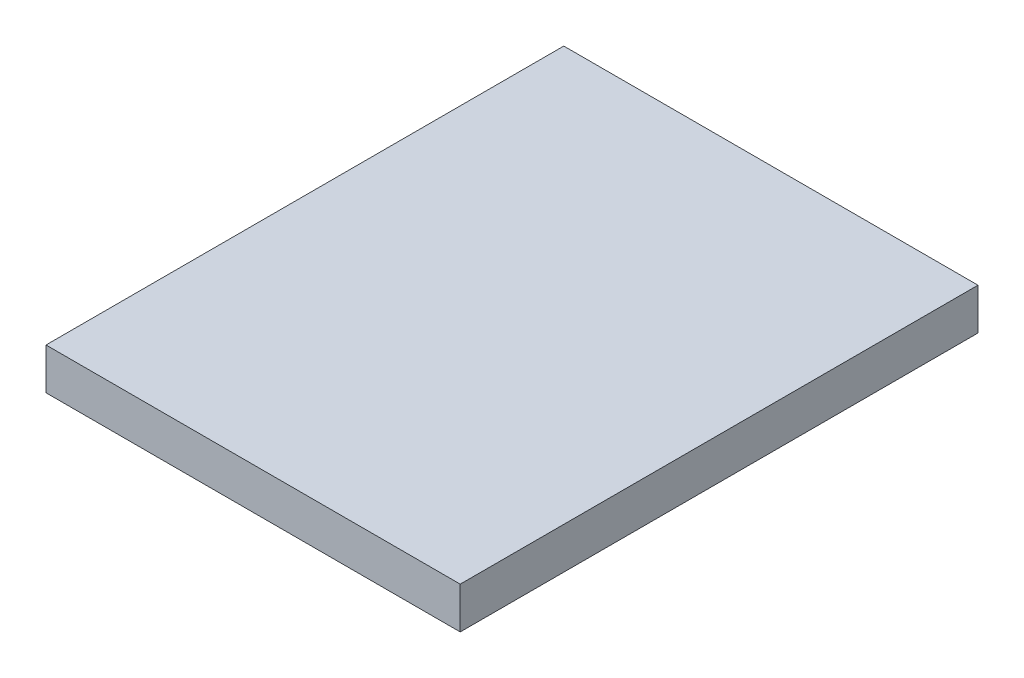
ISO-10303-21;
HEADER;
FILE_DESCRIPTION(('STEP AP214'),'2;1');
FILE_NAME('part.step','',(''),(''),'','','');
FILE_SCHEMA(('AUTOMOTIVE_DESIGN { 1 0 10303 214 1 1 1 1 }'));
ENDSEC;
DATA;
#1=APPLICATION_CONTEXT('core data for automotive mechanical design processes');
#2=APPLICATION_PROTOCOL_DEFINITION('international standard','automotive_design',2000,#1);
#3=PRODUCT_CONTEXT('',#1,'mechanical');
#4=PRODUCT('Part','Part','',(#3));
#5=PRODUCT_RELATED_PRODUCT_CATEGORY('part','',(#4));
#6=PRODUCT_DEFINITION_FORMATION('','',#4);
#7=PRODUCT_DEFINITION_CONTEXT('part definition',#1,'design');
#8=PRODUCT_DEFINITION('design','',#6,#7);
#9=PRODUCT_DEFINITION_SHAPE('','',#8);
#10=(LENGTH_UNIT() NAMED_UNIT(*) SI_UNIT(.MILLI.,.METRE.));
#11=(NAMED_UNIT(*) PLANE_ANGLE_UNIT() SI_UNIT($,.RADIAN.));
#12=(NAMED_UNIT(*) SI_UNIT($,.STERADIAN.) SOLID_ANGLE_UNIT());
#13=UNCERTAINTY_MEASURE_WITH_UNIT(LENGTH_MEASURE(1.E-05),#10,'distance_accuracy_value','');
#14=(GEOMETRIC_REPRESENTATION_CONTEXT(3) GLOBAL_UNCERTAINTY_ASSIGNED_CONTEXT((#13)) GLOBAL_UNIT_ASSIGNED_CONTEXT((#10,
#11,#12)) REPRESENTATION_CONTEXT('',''));
#15=CARTESIAN_POINT('',(0.,0.,0.));
#16=DIRECTION('',(0.,0.,1.));
#17=DIRECTION('',(1.,0.,0.));
#18=AXIS2_PLACEMENT_3D('',#15,#16,#17);
#19=CARTESIAN_POINT('',(-1000.,100.,-1250.));
#20=DIRECTION('',(1.,0.,0.));
#21=DIRECTION('',(0.,0.,-1.));
#22=AXIS2_PLACEMENT_3D('',#19,#20,#21);
#23=PLANE('',#22);
#24=DIRECTION('',(0.,0.,1.));
#25=VECTOR('',#24,1.);
#26=CARTESIAN_POINT('',(-1000.,-100.,-1250.));
#27=LINE('',#26,#25);
#28=CARTESIAN_POINT('',(-1000.,-100.,-1250.));
#29=VERTEX_POINT('',#28);
#30=CARTESIAN_POINT('',(-1000.,-100.,1250.));
#31=VERTEX_POINT('',#30);
#32=EDGE_CURVE('E107',#29,#31,#27,.T.);
#33=ORIENTED_EDGE('',*,*,#32,.T.);
#34=DIRECTION('',(0.,-1.,0.));
#35=VECTOR('',#34,1.);
#36=CARTESIAN_POINT('',(-1000.,100.,1250.));
#37=LINE('',#36,#35);
#38=CARTESIAN_POINT('',(-1000.,100.,1250.));
#39=VERTEX_POINT('',#38);
#40=EDGE_CURVE('E11',#39,#31,#37,.T.);
#41=ORIENTED_EDGE('',*,*,#40,.F.);
#42=DIRECTION('',(0.,0.,1.));
#43=VECTOR('',#42,1.);
#44=CARTESIAN_POINT('',(-1000.,100.,-1250.));
#45=LINE('',#44,#43);
#46=CARTESIAN_POINT('',(-1000.,100.,-1250.));
#47=VERTEX_POINT('',#46);
#48=EDGE_CURVE('E91',#47,#39,#45,.T.);
#49=ORIENTED_EDGE('',*,*,#48,.F.);
#50=DIRECTION('',(0.,-1.,0.));
#51=VECTOR('',#50,1.);
#52=CARTESIAN_POINT('',(-1000.,100.,-1250.));
#53=LINE('',#52,#51);
#54=EDGE_CURVE('E103',#47,#29,#53,.T.);
#55=ORIENTED_EDGE('',*,*,#54,.T.);
#56=EDGE_LOOP('',(#33,#41,#49,#55));
#57=FACE_BOUND('',#56,.T.);
#58=ADVANCED_FACE('F39',(#57),#23,.F.);
#59=CARTESIAN_POINT('',(1000.,100.,1250.));
#60=DIRECTION('',(0.,0.,-1.));
#61=DIRECTION('',(-1.,0.,0.));
#62=AXIS2_PLACEMENT_3D('',#59,#60,#61);
#63=PLANE('',#62);
#64=DIRECTION('',(1.,0.,0.));
#65=VECTOR('',#64,1.);
#66=CARTESIAN_POINT('',(1000.,-100.,1250.));
#67=LINE('',#66,#65);
#68=CARTESIAN_POINT('',(1000.,-100.,1250.));
#69=VERTEX_POINT('',#68);
#70=EDGE_CURVE('E96',#31,#69,#67,.T.);
#71=ORIENTED_EDGE('',*,*,#70,.T.);
#72=DIRECTION('',(0.,-1.,0.));
#73=VECTOR('',#72,1.);
#74=CARTESIAN_POINT('',(1000.,100.,1250.));
#75=LINE('',#74,#73);
#76=CARTESIAN_POINT('',(1000.,100.,1250.));
#77=VERTEX_POINT('',#76);
#78=EDGE_CURVE('E48',#77,#69,#75,.T.);
#79=ORIENTED_EDGE('',*,*,#78,.F.);
#80=DIRECTION('',(1.,0.,0.));
#81=VECTOR('',#80,1.);
#82=CARTESIAN_POINT('',(1000.,100.,1250.));
#83=LINE('',#82,#81);
#84=EDGE_CURVE('E86',#39,#77,#83,.T.);
#85=ORIENTED_EDGE('',*,*,#84,.F.);
#86=ORIENTED_EDGE('',*,*,#40,.T.);
#87=EDGE_LOOP('',(#71,#79,#85,#86));
#88=FACE_BOUND('',#87,.T.);
#89=ADVANCED_FACE('F95',(#88),#63,.F.);
#90=CARTESIAN_POINT('',(1000.,100.,-1250.));
#91=DIRECTION('',(-1.,0.,0.));
#92=DIRECTION('',(0.,0.,1.));
#93=AXIS2_PLACEMENT_3D('',#90,#91,#92);
#94=PLANE('',#93);
#95=DIRECTION('',(0.,0.,-1.));
#96=VECTOR('',#95,1.);
#97=CARTESIAN_POINT('',(1000.,-100.,-1250.));
#98=LINE('',#97,#96);
#99=CARTESIAN_POINT('',(1000.,-100.,-1250.));
#100=VERTEX_POINT('',#99);
#101=EDGE_CURVE('E73',#69,#100,#98,.T.);
#102=ORIENTED_EDGE('',*,*,#101,.T.);
#103=DIRECTION('',(0.,-1.,0.));
#104=VECTOR('',#103,1.);
#105=CARTESIAN_POINT('',(1000.,100.,-1250.));
#106=LINE('',#105,#104);
#107=CARTESIAN_POINT('',(1000.,100.,-1250.));
#108=VERTEX_POINT('',#107);
#109=EDGE_CURVE('E98',#108,#100,#106,.T.);
#110=ORIENTED_EDGE('',*,*,#109,.F.);
#111=DIRECTION('',(0.,0.,-1.));
#112=VECTOR('',#111,1.);
#113=CARTESIAN_POINT('',(1000.,100.,-1250.));
#114=LINE('',#113,#112);
#115=EDGE_CURVE('E89',#77,#108,#114,.T.);
#116=ORIENTED_EDGE('',*,*,#115,.F.);
#117=ORIENTED_EDGE('',*,*,#78,.T.);
#118=EDGE_LOOP('',(#102,#110,#116,#117));
#119=FACE_BOUND('',#118,.T.);
#120=ADVANCED_FACE('F99',(#119),#94,.F.);
#121=CARTESIAN_POINT('',(1000.,100.,-1250.));
#122=DIRECTION('',(0.,0.,1.));
#123=DIRECTION('',(1.,0.,0.));
#124=AXIS2_PLACEMENT_3D('',#121,#122,#123);
#125=PLANE('',#124);
#126=DIRECTION('',(-1.,0.,0.));
#127=VECTOR('',#126,1.);
#128=CARTESIAN_POINT('',(1000.,-100.,-1250.));
#129=LINE('',#128,#127);
#130=EDGE_CURVE('E79',#100,#29,#129,.T.);
#131=ORIENTED_EDGE('',*,*,#130,.T.);
#132=ORIENTED_EDGE('',*,*,#54,.F.);
#133=DIRECTION('',(-1.,0.,0.));
#134=VECTOR('',#133,1.);
#135=CARTESIAN_POINT('',(1000.,100.,-1250.));
#136=LINE('',#135,#134);
#137=EDGE_CURVE('E56',#108,#47,#136,.T.);
#138=ORIENTED_EDGE('',*,*,#137,.F.);
#139=ORIENTED_EDGE('',*,*,#109,.T.);
#140=EDGE_LOOP('',(#131,#132,#138,#139));
#141=FACE_BOUND('',#140,.T.);
#142=ADVANCED_FACE('F120',(#141),#125,.F.);
#143=CARTESIAN_POINT('',(0.,100.,0.));
#144=DIRECTION('',(0.,-1.,0.));
#145=DIRECTION('',(0.,0.,-1.));
#146=AXIS2_PLACEMENT_3D('',#143,#144,#145);
#147=PLANE('',#146);
#148=ORIENTED_EDGE('',*,*,#48,.T.);
#149=ORIENTED_EDGE('',*,*,#84,.T.);
#150=ORIENTED_EDGE('',*,*,#115,.T.);
#151=ORIENTED_EDGE('',*,*,#137,.T.);
#152=EDGE_LOOP('',(#148,#149,#150,#151));
#153=FACE_BOUND('',#152,.T.);
#154=ADVANCED_FACE('F87',(#153),#147,.F.);
#155=CARTESIAN_POINT('',(0.,-100.,0.));
#156=DIRECTION('',(0.,-1.,0.));
#157=DIRECTION('',(0.,0.,-1.));
#158=AXIS2_PLACEMENT_3D('',#155,#156,#157);
#159=PLANE('',#158);
#160=ORIENTED_EDGE('',*,*,#32,.F.);
#161=ORIENTED_EDGE('',*,*,#130,.F.);
#162=ORIENTED_EDGE('',*,*,#101,.F.);
#163=ORIENTED_EDGE('',*,*,#70,.F.);
#164=EDGE_LOOP('',(#160,#161,#162,#163));
#165=FACE_BOUND('',#164,.T.);
#166=ADVANCED_FACE('F123',(#165),#159,.T.);
#167=CLOSED_SHELL('',(#58,#89,#120,#142,#154,#166));
#168=MANIFOLD_SOLID_BREP('B2',#167);
#169=ADVANCED_BREP_SHAPE_REPRESENTATION('',(#18,#168),#14);
#170=SHAPE_DEFINITION_REPRESENTATION(#9,#169);
ENDSEC;
END-ISO-10303-21;
